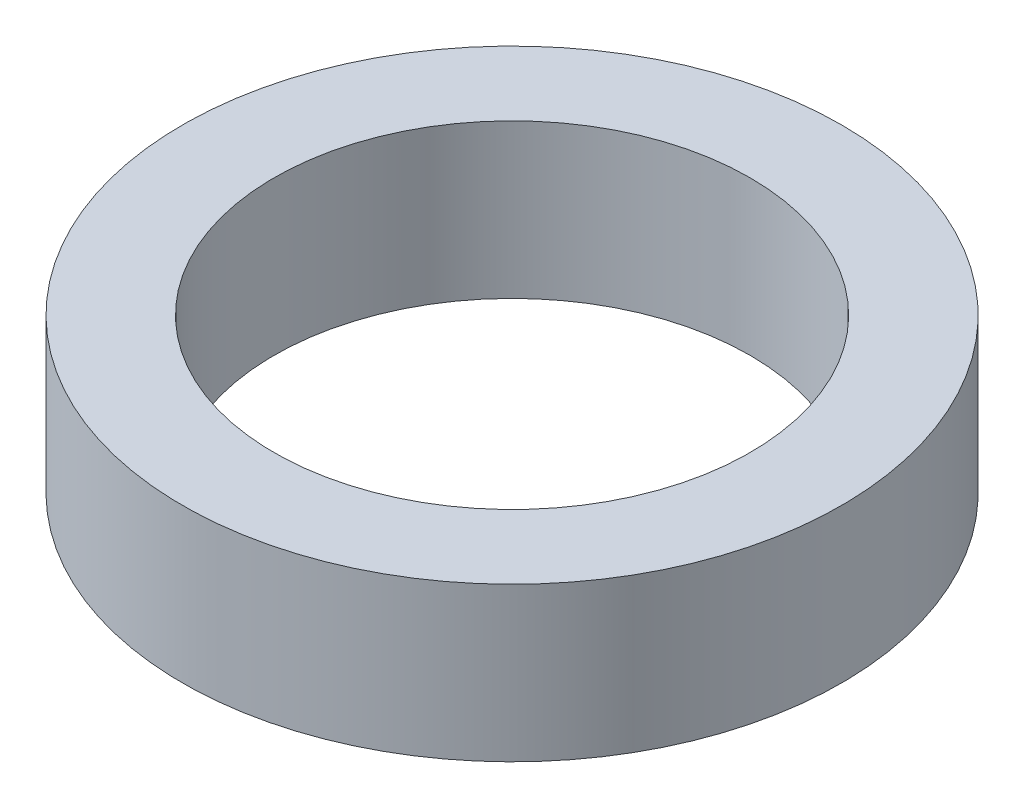
ISO-10303-21;
HEADER;
FILE_DESCRIPTION(('STEP AP214'),'2;1');
FILE_NAME('part.step','',(''),(''),'','','');
FILE_SCHEMA(('AUTOMOTIVE_DESIGN { 1 0 10303 214 1 1 1 1 }'));
ENDSEC;
DATA;
#1=APPLICATION_CONTEXT('core data for automotive mechanical design processes');
#2=APPLICATION_PROTOCOL_DEFINITION('international standard','automotive_design',2000,#1);
#3=PRODUCT_CONTEXT('',#1,'mechanical');
#4=PRODUCT('Part','Part','',(#3));
#5=PRODUCT_RELATED_PRODUCT_CATEGORY('part','',(#4));
#6=PRODUCT_DEFINITION_FORMATION('','',#4);
#7=PRODUCT_DEFINITION_CONTEXT('part definition',#1,'design');
#8=PRODUCT_DEFINITION('design','',#6,#7);
#9=PRODUCT_DEFINITION_SHAPE('','',#8);
#10=(LENGTH_UNIT() NAMED_UNIT(*) SI_UNIT(.MILLI.,.METRE.));
#11=(NAMED_UNIT(*) PLANE_ANGLE_UNIT() SI_UNIT($,.RADIAN.));
#12=(NAMED_UNIT(*) SI_UNIT($,.STERADIAN.) SOLID_ANGLE_UNIT());
#13=UNCERTAINTY_MEASURE_WITH_UNIT(LENGTH_MEASURE(1.E-05),#10,'distance_accuracy_value','');
#14=(GEOMETRIC_REPRESENTATION_CONTEXT(3) GLOBAL_UNCERTAINTY_ASSIGNED_CONTEXT((#13)) GLOBAL_UNIT_ASSIGNED_CONTEXT((#10,
#11,#12)) REPRESENTATION_CONTEXT('',''));
#15=CARTESIAN_POINT('',(0.,0.,0.));
#16=DIRECTION('',(0.,0.,1.));
#17=DIRECTION('',(1.,0.,0.));
#18=AXIS2_PLACEMENT_3D('',#15,#16,#17);
#19=CARTESIAN_POINT('',(0.,21.,0.));
#20=DIRECTION('',(0.,-1.,0.));
#21=DIRECTION('',(0.,0.,-1.));
#22=AXIS2_PLACEMENT_3D('',#19,#20,#21);
#23=CYLINDRICAL_SURFACE('',#22,45.);
#24=CARTESIAN_POINT('',(0.,21.,0.));
#25=DIRECTION('',(0.,1.,0.));
#26=DIRECTION('',(0.,0.,1.));
#27=AXIS2_PLACEMENT_3D('',#24,#25,#26);
#28=CIRCLE('',#27,45.);
#29=CARTESIAN_POINT('',(0.,21.,-45.));
#30=VERTEX_POINT('',#29);
#31=EDGE_CURVE('E10',#30,#30,#28,.T.);
#32=CARTESIAN_POINT('',(0.,0.,0.));
#33=DIRECTION('',(0.,1.,0.));
#34=DIRECTION('',(0.,0.,1.));
#35=AXIS2_PLACEMENT_3D('',#32,#33,#34);
#36=CIRCLE('',#35,45.);
#37=CARTESIAN_POINT('',(0.,0.,-45.));
#38=VERTEX_POINT('',#37);
#39=EDGE_CURVE('E37',#38,#38,#36,.T.);
#40=CARTESIAN_POINT('',(0.,21.,-45.));
#41=CARTESIAN_POINT('',(0.,20.78125,-45.));
#42=CARTESIAN_POINT('',(0.,20.5625,-45.));
#43=CARTESIAN_POINT('',(0.,20.125,-45.));
#44=CARTESIAN_POINT('',(0.,19.90625,-45.));
#45=CARTESIAN_POINT('',(0.,19.46875,-45.));
#46=CARTESIAN_POINT('',(0.,19.25,-45.));
#47=CARTESIAN_POINT('',(0.,18.8125,-45.));
#48=CARTESIAN_POINT('',(0.,18.59375,-45.));
#49=CARTESIAN_POINT('',(0.,18.15625,-45.));
#50=CARTESIAN_POINT('',(0.,17.9375,-45.));
#51=CARTESIAN_POINT('',(0.,17.5,-45.));
#52=CARTESIAN_POINT('',(0.,17.28125,-45.));
#53=CARTESIAN_POINT('',(0.,16.84375,-45.));
#54=CARTESIAN_POINT('',(0.,16.625,-45.));
#55=CARTESIAN_POINT('',(0.,16.1875,-45.));
#56=CARTESIAN_POINT('',(0.,15.96875,-45.));
#57=CARTESIAN_POINT('',(0.,15.53125,-45.));
#58=CARTESIAN_POINT('',(0.,15.3125,-45.));
#59=CARTESIAN_POINT('',(0.,14.875,-45.));
#60=CARTESIAN_POINT('',(0.,14.65625,-45.));
#61=CARTESIAN_POINT('',(0.,14.21875,-45.));
#62=CARTESIAN_POINT('',(0.,14.,-45.));
#63=CARTESIAN_POINT('',(0.,13.5625,-45.));
#64=CARTESIAN_POINT('',(0.,13.34375,-45.));
#65=CARTESIAN_POINT('',(0.,12.90625,-45.));
#66=CARTESIAN_POINT('',(0.,12.6875,-45.));
#67=CARTESIAN_POINT('',(0.,12.25,-45.));
#68=CARTESIAN_POINT('',(0.,12.03125,-45.));
#69=CARTESIAN_POINT('',(0.,11.59375,-45.));
#70=CARTESIAN_POINT('',(0.,11.375,-45.));
#71=CARTESIAN_POINT('',(0.,10.9375,-45.));
#72=CARTESIAN_POINT('',(0.,10.71875,-45.));
#73=CARTESIAN_POINT('',(0.,10.28125,-45.));
#74=CARTESIAN_POINT('',(0.,10.0625,-45.));
#75=CARTESIAN_POINT('',(0.,9.625,-45.));
#76=CARTESIAN_POINT('',(0.,9.40625,-45.));
#77=CARTESIAN_POINT('',(0.,8.96875,-45.));
#78=CARTESIAN_POINT('',(0.,8.75,-45.));
#79=CARTESIAN_POINT('',(0.,8.3125,-45.));
#80=CARTESIAN_POINT('',(0.,8.09375,-45.));
#81=CARTESIAN_POINT('',(0.,7.65625,-45.));
#82=CARTESIAN_POINT('',(0.,7.4375,-45.));
#83=CARTESIAN_POINT('',(0.,7.,-45.));
#84=CARTESIAN_POINT('',(0.,6.78125,-45.));
#85=CARTESIAN_POINT('',(0.,6.34375,-45.));
#86=CARTESIAN_POINT('',(0.,6.125,-45.));
#87=CARTESIAN_POINT('',(0.,5.6875,-45.));
#88=CARTESIAN_POINT('',(0.,5.46875,-45.));
#89=CARTESIAN_POINT('',(0.,5.03125,-45.));
#90=CARTESIAN_POINT('',(0.,4.8125,-45.));
#91=CARTESIAN_POINT('',(0.,4.375,-45.));
#92=CARTESIAN_POINT('',(0.,4.15625,-45.));
#93=CARTESIAN_POINT('',(0.,3.71875,-45.));
#94=CARTESIAN_POINT('',(0.,3.5,-45.));
#95=CARTESIAN_POINT('',(0.,3.0625,-45.));
#96=CARTESIAN_POINT('',(0.,2.84375,-45.));
#97=CARTESIAN_POINT('',(0.,2.40625,-45.));
#98=CARTESIAN_POINT('',(0.,2.1875,-45.));
#99=CARTESIAN_POINT('',(0.,1.75,-45.));
#100=CARTESIAN_POINT('',(0.,1.53125,-45.));
#101=CARTESIAN_POINT('',(0.,1.09375,-45.));
#102=CARTESIAN_POINT('',(0.,0.875000000000001,-45.));
#103=CARTESIAN_POINT('',(0.,0.4375,-45.));
#104=CARTESIAN_POINT('',(0.,0.21875,-45.));
#105=CARTESIAN_POINT('',(0.,0.,-45.));
#106=B_SPLINE_CURVE_WITH_KNOTS('',3,(#40,#41,#42,#43,#44,#45,#46,#47,#48,#49,#50,#51,#52,#53,
#54,#55,#56,#57,#58,#59,#60,#61,#62,#63,#64,#65,#66,#67,#68,#69,#70,#71,#72,#73,#74,#75,#76,#77,
#78,#79,#80,#81,#82,#83,#84,#85,#86,#87,#88,#89,#90,#91,#92,#93,#94,#95,#96,#97,#98,#99,#100,
#101,#102,#103,#104,#105),.UNSPECIFIED.,.F.,.F.,(4,2,2,2,2,2,2,2,2,2,2,2,2,2,2,2,2,2,2,2,2,2,2,
2,2,2,2,2,2,2,2,2,4),(0.,0.656250000000001,1.3125,1.96875,2.625,3.28125,3.9375,4.59375,5.25,
5.90625,6.5625,7.21875,7.875,8.53125,9.1875,9.84375,10.5,11.15625,11.8125,12.46875,13.125,
13.78125,14.4375,15.09375,15.75,16.40625,17.0625,17.71875,18.375,19.03125,19.6875,20.34375,21.),.UNSPECIFIED.);
#107=EDGE_CURVE('BSEAM40',#30,#38,#106,.T.);
#108=ORIENTED_EDGE('',*,*,#31,.F.);
#109=ORIENTED_EDGE('',*,*,#39,.T.);
#110=ORIENTED_EDGE('',*,*,#107,.T.);
#111=ORIENTED_EDGE('',*,*,#107,.F.);
#112=EDGE_LOOP('',(#108,#110,#109,#111));
#113=FACE_BOUND('',#112,.T.);
#114=ADVANCED_FACE('F40',(#113),#23,.T.);
#115=CARTESIAN_POINT('',(0.,21.,0.));
#116=DIRECTION('',(0.,1.,0.));
#117=DIRECTION('',(0.,0.,1.));
#118=AXIS2_PLACEMENT_3D('',#115,#116,#117);
#119=PLANE('',#118);
#120=CARTESIAN_POINT('',(0.,21.,0.));
#121=DIRECTION('',(0.,1.,0.));
#122=DIRECTION('',(0.,0.,1.));
#123=AXIS2_PLACEMENT_3D('',#120,#121,#122);
#124=CIRCLE('',#123,32.5);
#125=CARTESIAN_POINT('',(0.,21.,-32.5));
#126=VERTEX_POINT('',#125);
#127=EDGE_CURVE('E50',#126,#126,#124,.T.);
#128=ORIENTED_EDGE('',*,*,#127,.F.);
#129=EDGE_LOOP('',(#128));
#130=FACE_BOUND('',#129,.T.);
#131=ORIENTED_EDGE('',*,*,#31,.T.);
#132=EDGE_LOOP('',(#131));
#133=FACE_BOUND('',#132,.T.);
#134=ADVANCED_FACE('F59',(#130,#133),#119,.T.);
#135=CARTESIAN_POINT('',(0.,0.,0.));
#136=DIRECTION('',(0.,1.,0.));
#137=DIRECTION('',(0.,0.,1.));
#138=AXIS2_PLACEMENT_3D('',#135,#136,#137);
#139=PLANE('',#138);
#140=CARTESIAN_POINT('',(0.,0.,0.));
#141=DIRECTION('',(0.,1.,0.));
#142=DIRECTION('',(0.,0.,1.));
#143=AXIS2_PLACEMENT_3D('',#140,#141,#142);
#144=CIRCLE('',#143,32.5);
#145=CARTESIAN_POINT('',(0.,0.,-32.5));
#146=VERTEX_POINT('',#145);
#147=EDGE_CURVE('E47',#146,#146,#144,.T.);
#148=ORIENTED_EDGE('',*,*,#147,.T.);
#149=EDGE_LOOP('',(#148));
#150=FACE_BOUND('',#149,.T.);
#151=ORIENTED_EDGE('',*,*,#39,.F.);
#152=EDGE_LOOP('',(#151));
#153=FACE_BOUND('',#152,.T.);
#154=ADVANCED_FACE('F58',(#150,#153),#139,.F.);
#155=CARTESIAN_POINT('',(0.,21.,0.));
#156=DIRECTION('',(0.,-1.,0.));
#157=DIRECTION('',(0.,0.,-1.));
#158=AXIS2_PLACEMENT_3D('',#155,#156,#157);
#159=CYLINDRICAL_SURFACE('',#158,32.5);
#160=CARTESIAN_POINT('',(0.,21.,-32.5));
#161=CARTESIAN_POINT('',(0.,20.78125,-32.5));
#162=CARTESIAN_POINT('',(0.,20.5625,-32.5));
#163=CARTESIAN_POINT('',(0.,20.125,-32.5));
#164=CARTESIAN_POINT('',(0.,19.90625,-32.5));
#165=CARTESIAN_POINT('',(0.,19.46875,-32.5));
#166=CARTESIAN_POINT('',(0.,19.25,-32.5));
#167=CARTESIAN_POINT('',(0.,18.8125,-32.5));
#168=CARTESIAN_POINT('',(0.,18.59375,-32.5));
#169=CARTESIAN_POINT('',(0.,18.15625,-32.5));
#170=CARTESIAN_POINT('',(0.,17.9375,-32.5));
#171=CARTESIAN_POINT('',(0.,17.5,-32.5));
#172=CARTESIAN_POINT('',(0.,17.28125,-32.5));
#173=CARTESIAN_POINT('',(0.,16.84375,-32.5));
#174=CARTESIAN_POINT('',(0.,16.625,-32.5));
#175=CARTESIAN_POINT('',(0.,16.1875,-32.5));
#176=CARTESIAN_POINT('',(0.,15.96875,-32.5));
#177=CARTESIAN_POINT('',(0.,15.53125,-32.5));
#178=CARTESIAN_POINT('',(0.,15.3125,-32.5));
#179=CARTESIAN_POINT('',(0.,14.875,-32.5));
#180=CARTESIAN_POINT('',(0.,14.65625,-32.5));
#181=CARTESIAN_POINT('',(0.,14.21875,-32.5));
#182=CARTESIAN_POINT('',(0.,14.,-32.5));
#183=CARTESIAN_POINT('',(0.,13.5625,-32.5));
#184=CARTESIAN_POINT('',(0.,13.34375,-32.5));
#185=CARTESIAN_POINT('',(0.,12.90625,-32.5));
#186=CARTESIAN_POINT('',(0.,12.6875,-32.5));
#187=CARTESIAN_POINT('',(0.,12.25,-32.5));
#188=CARTESIAN_POINT('',(0.,12.03125,-32.5));
#189=CARTESIAN_POINT('',(0.,11.59375,-32.5));
#190=CARTESIAN_POINT('',(0.,11.375,-32.5));
#191=CARTESIAN_POINT('',(0.,10.9375,-32.5));
#192=CARTESIAN_POINT('',(0.,10.71875,-32.5));
#193=CARTESIAN_POINT('',(0.,10.28125,-32.5));
#194=CARTESIAN_POINT('',(0.,10.0625,-32.5));
#195=CARTESIAN_POINT('',(0.,9.625,-32.5));
#196=CARTESIAN_POINT('',(0.,9.40625,-32.5));
#197=CARTESIAN_POINT('',(0.,8.96875,-32.5));
#198=CARTESIAN_POINT('',(0.,8.75,-32.5));
#199=CARTESIAN_POINT('',(0.,8.3125,-32.5));
#200=CARTESIAN_POINT('',(0.,8.09375,-32.5));
#201=CARTESIAN_POINT('',(0.,7.65625,-32.5));
#202=CARTESIAN_POINT('',(0.,7.4375,-32.5));
#203=CARTESIAN_POINT('',(0.,7.,-32.5));
#204=CARTESIAN_POINT('',(0.,6.78125,-32.5));
#205=CARTESIAN_POINT('',(0.,6.34375,-32.5));
#206=CARTESIAN_POINT('',(0.,6.125,-32.5));
#207=CARTESIAN_POINT('',(0.,5.6875,-32.5));
#208=CARTESIAN_POINT('',(0.,5.46875,-32.5));
#209=CARTESIAN_POINT('',(0.,5.03125,-32.5));
#210=CARTESIAN_POINT('',(0.,4.8125,-32.5));
#211=CARTESIAN_POINT('',(0.,4.375,-32.5));
#212=CARTESIAN_POINT('',(0.,4.15625,-32.5));
#213=CARTESIAN_POINT('',(0.,3.71875,-32.5));
#214=CARTESIAN_POINT('',(0.,3.5,-32.5));
#215=CARTESIAN_POINT('',(0.,3.0625,-32.5));
#216=CARTESIAN_POINT('',(0.,2.84375,-32.5));
#217=CARTESIAN_POINT('',(0.,2.40625,-32.5));
#218=CARTESIAN_POINT('',(0.,2.1875,-32.5));
#219=CARTESIAN_POINT('',(0.,1.75,-32.5));
#220=CARTESIAN_POINT('',(0.,1.53125,-32.5));
#221=CARTESIAN_POINT('',(0.,1.09375,-32.5));
#222=CARTESIAN_POINT('',(0.,0.875000000000001,-32.5));
#223=CARTESIAN_POINT('',(0.,0.4375,-32.5));
#224=CARTESIAN_POINT('',(0.,0.21875,-32.5));
#225=CARTESIAN_POINT('',(0.,0.,-32.5));
#226=B_SPLINE_CURVE_WITH_KNOTS('',3,(#160,#161,#162,#163,#164,#165,#166,#167,#168,#169,#170,
#171,#172,#173,#174,#175,#176,#177,#178,#179,#180,#181,#182,#183,#184,#185,#186,#187,#188,#189,
#190,#191,#192,#193,#194,#195,#196,#197,#198,#199,#200,#201,#202,#203,#204,#205,#206,#207,#208,
#209,#210,#211,#212,#213,#214,#215,#216,#217,#218,#219,#220,#221,#222,#223,#224,#225),
.UNSPECIFIED.,.F.,.F.,(4,2,2,2,2,2,2,2,2,2,2,2,2,2,2,2,2,2,2,2,2,2,2,2,2,2,2,2,2,2,2,2,4),(0.,
0.656249999999997,1.3125,1.96875,2.625,3.28125,3.9375,4.59375,5.25,5.90625,6.5625,7.21875,7.875,
8.53125,9.1875,9.84375,10.5,11.15625,11.8125,12.46875,13.125,13.78125,14.4375,15.09375,15.75,
16.40625,17.0625,17.71875,18.375,19.03125,19.6875,20.34375,21.),.UNSPECIFIED.);
#227=EDGE_CURVE('BSEAM54',#126,#146,#226,.T.);
#228=ORIENTED_EDGE('',*,*,#127,.T.);
#229=ORIENTED_EDGE('',*,*,#147,.F.);
#230=ORIENTED_EDGE('',*,*,#227,.T.);
#231=ORIENTED_EDGE('',*,*,#227,.F.);
#232=EDGE_LOOP('',(#228,#230,#229,#231));
#233=FACE_BOUND('',#232,.T.);
#234=ADVANCED_FACE('F54',(#233),#159,.F.);
#235=CLOSED_SHELL('',(#114,#134,#154,#234));
#236=MANIFOLD_SOLID_BREP('B2',#235);
#237=ADVANCED_BREP_SHAPE_REPRESENTATION('',(#18,#236),#14);
#238=SHAPE_DEFINITION_REPRESENTATION(#9,#237);
ENDSEC;
END-ISO-10303-21;
